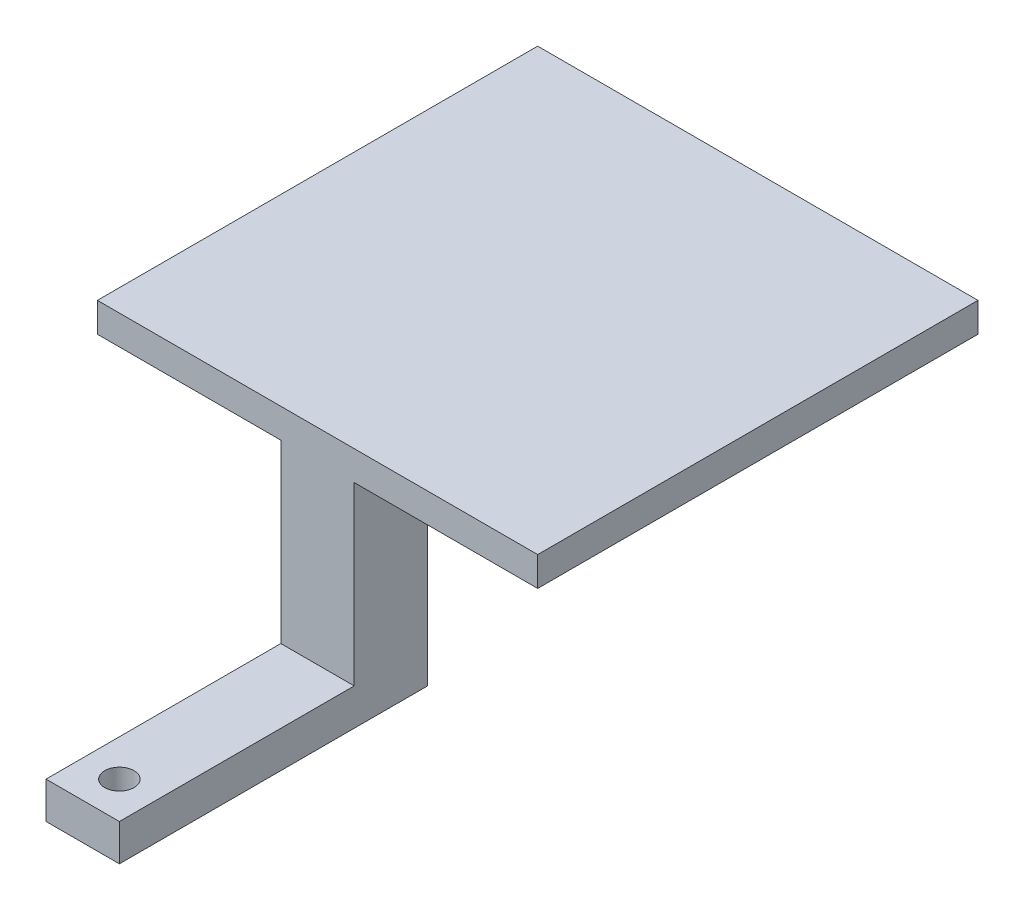
ISO-10303-21;
HEADER;
FILE_DESCRIPTION(('STEP AP214'),'2;1');
FILE_NAME('part.step','',(''),(''),'','','');
FILE_SCHEMA(('AUTOMOTIVE_DESIGN { 1 0 10303 214 1 1 1 1 }'));
ENDSEC;
DATA;
#1=APPLICATION_CONTEXT('core data for automotive mechanical design processes');
#2=APPLICATION_PROTOCOL_DEFINITION('international standard','automotive_design',2000,#1);
#3=PRODUCT_CONTEXT('',#1,'mechanical');
#4=PRODUCT('Part','Part','',(#3));
#5=PRODUCT_RELATED_PRODUCT_CATEGORY('part','',(#4));
#6=PRODUCT_DEFINITION_FORMATION('','',#4);
#7=PRODUCT_DEFINITION_CONTEXT('part definition',#1,'design');
#8=PRODUCT_DEFINITION('design','',#6,#7);
#9=PRODUCT_DEFINITION_SHAPE('','',#8);
#10=(LENGTH_UNIT() NAMED_UNIT(*) SI_UNIT(.MILLI.,.METRE.));
#11=(NAMED_UNIT(*) PLANE_ANGLE_UNIT() SI_UNIT($,.RADIAN.));
#12=(NAMED_UNIT(*) SI_UNIT($,.STERADIAN.) SOLID_ANGLE_UNIT());
#13=UNCERTAINTY_MEASURE_WITH_UNIT(LENGTH_MEASURE(1.E-05),#10,'distance_accuracy_value','');
#14=(GEOMETRIC_REPRESENTATION_CONTEXT(3) GLOBAL_UNCERTAINTY_ASSIGNED_CONTEXT((#13)) GLOBAL_UNIT_ASSIGNED_CONTEXT((#10,
#11,#12)) REPRESENTATION_CONTEXT('',''));
#15=CARTESIAN_POINT('',(0.,0.,0.));
#16=DIRECTION('',(0.,0.,1.));
#17=DIRECTION('',(1.,0.,0.));
#18=AXIS2_PLACEMENT_3D('',#15,#16,#17);
#19=CARTESIAN_POINT('',(-15.,2.,15.));
#20=DIRECTION('',(0.,0.,-1.));
#21=DIRECTION('',(-1.,0.,0.));
#22=AXIS2_PLACEMENT_3D('',#19,#20,#21);
#23=PLANE('',#22);
#24=DIRECTION('',(-1.,0.,0.));
#25=VECTOR('',#24,1.);
#26=CARTESIAN_POINT('',(2.50000000000001,-12.,15.));
#27=LINE('',#26,#25);
#28=CARTESIAN_POINT('',(2.50000000000001,-12.,15.));
#29=VERTEX_POINT('',#28);
#30=CARTESIAN_POINT('',(-2.5,-12.,15.));
#31=VERTEX_POINT('',#30);
#32=EDGE_CURVE('E56',#29,#31,#27,.T.);
#33=ORIENTED_EDGE('',*,*,#32,.F.);
#34=DIRECTION('',(0.,1.,0.));
#35=VECTOR('',#34,1.);
#36=CARTESIAN_POINT('',(2.50000000000001,-14.5,15.));
#37=LINE('',#36,#35);
#38=CARTESIAN_POINT('',(2.50000000000001,0.,15.));
#39=VERTEX_POINT('',#38);
#40=EDGE_CURVE('E167',#29,#39,#37,.T.);
#41=ORIENTED_EDGE('',*,*,#40,.T.);
#42=DIRECTION('',(1.,0.,0.));
#43=VECTOR('',#42,1.);
#44=CARTESIAN_POINT('',(-15.,0.,15.));
#45=LINE('',#44,#43);
#46=CARTESIAN_POINT('',(15.,0.,15.));
#47=VERTEX_POINT('',#46);
#48=EDGE_CURVE('E190',#39,#47,#45,.T.);
#49=ORIENTED_EDGE('',*,*,#48,.T.);
#50=DIRECTION('',(0.,-1.,0.));
#51=VECTOR('',#50,1.);
#52=CARTESIAN_POINT('',(15.,2.,15.));
#53=LINE('',#52,#51);
#54=CARTESIAN_POINT('',(15.,2.,15.));
#55=VERTEX_POINT('',#54);
#56=EDGE_CURVE('E183',#55,#47,#53,.T.);
#57=ORIENTED_EDGE('',*,*,#56,.F.);
#58=DIRECTION('',(1.,0.,0.));
#59=VECTOR('',#58,1.);
#60=CARTESIAN_POINT('',(-15.,2.,15.));
#61=LINE('',#60,#59);
#62=CARTESIAN_POINT('',(-15.,2.,15.));
#63=VERTEX_POINT('',#62);
#64=EDGE_CURVE('E181',#63,#55,#61,.T.);
#65=ORIENTED_EDGE('',*,*,#64,.F.);
#66=DIRECTION('',(0.,-1.,0.));
#67=VECTOR('',#66,1.);
#68=CARTESIAN_POINT('',(-15.,2.,15.));
#69=LINE('',#68,#67);
#70=CARTESIAN_POINT('',(-15.,0.,15.));
#71=VERTEX_POINT('',#70);
#72=EDGE_CURVE('E195',#63,#71,#69,.T.);
#73=ORIENTED_EDGE('',*,*,#72,.T.);
#74=CARTESIAN_POINT('',(-2.5,0.,15.));
#75=VERTEX_POINT('',#74);
#76=EDGE_CURVE('E177',#71,#75,#45,.T.);
#77=ORIENTED_EDGE('',*,*,#76,.T.);
#78=DIRECTION('',(0.,1.,0.));
#79=VECTOR('',#78,1.);
#80=CARTESIAN_POINT('',(-2.5,-14.5,15.));
#81=LINE('',#80,#79);
#82=EDGE_CURVE('E165',#31,#75,#81,.T.);
#83=ORIENTED_EDGE('',*,*,#82,.F.);
#84=EDGE_LOOP('',(#33,#41,#49,#57,#65,#73,#77,#83));
#85=FACE_BOUND('',#84,.T.);
#86=ADVANCED_FACE('F40',(#85),#23,.F.);
#87=CARTESIAN_POINT('',(0.,0.,0.));
#88=DIRECTION('',(0.,1.,0.));
#89=DIRECTION('',(0.,0.,1.));
#90=AXIS2_PLACEMENT_3D('',#87,#88,#89);
#91=PLANE('',#90);
#92=DIRECTION('',(0.,0.,-1.));
#93=VECTOR('',#92,1.);
#94=CARTESIAN_POINT('',(-2.5,0.,0.));
#95=LINE('',#94,#93);
#96=CARTESIAN_POINT('',(-2.5,0.,10.));
#97=VERTEX_POINT('',#96);
#98=EDGE_CURVE('E157',#75,#97,#95,.T.);
#99=ORIENTED_EDGE('',*,*,#98,.F.);
#100=ORIENTED_EDGE('',*,*,#76,.F.);
#101=DIRECTION('',(0.,0.,1.));
#102=VECTOR('',#101,1.);
#103=CARTESIAN_POINT('',(-15.,0.,-15.));
#104=LINE('',#103,#102);
#105=CARTESIAN_POINT('',(-15.,0.,-15.));
#106=VERTEX_POINT('',#105);
#107=EDGE_CURVE('E188',#106,#71,#104,.T.);
#108=ORIENTED_EDGE('',*,*,#107,.F.);
#109=DIRECTION('',(-1.,0.,0.));
#110=VECTOR('',#109,1.);
#111=CARTESIAN_POINT('',(-15.,0.,-15.));
#112=LINE('',#111,#110);
#113=CARTESIAN_POINT('',(15.,0.,-15.));
#114=VERTEX_POINT('',#113);
#115=EDGE_CURVE('E186',#114,#106,#112,.T.);
#116=ORIENTED_EDGE('',*,*,#115,.F.);
#117=DIRECTION('',(0.,0.,-1.));
#118=VECTOR('',#117,1.);
#119=CARTESIAN_POINT('',(15.,0.,-15.));
#120=LINE('',#119,#118);
#121=EDGE_CURVE('E172',#47,#114,#120,.T.);
#122=ORIENTED_EDGE('',*,*,#121,.F.);
#123=ORIENTED_EDGE('',*,*,#48,.F.);
#124=DIRECTION('',(0.,0.,1.));
#125=VECTOR('',#124,1.);
#126=CARTESIAN_POINT('',(2.50000000000001,0.,0.));
#127=LINE('',#126,#125);
#128=CARTESIAN_POINT('',(2.50000000000001,0.,10.));
#129=VERTEX_POINT('',#128);
#130=EDGE_CURVE('E160',#129,#39,#127,.T.);
#131=ORIENTED_EDGE('',*,*,#130,.F.);
#132=DIRECTION('',(1.,0.,0.));
#133=VECTOR('',#132,1.);
#134=CARTESIAN_POINT('',(0.,0.,10.));
#135=LINE('',#134,#133);
#136=EDGE_CURVE('E64',#97,#129,#135,.T.);
#137=ORIENTED_EDGE('',*,*,#136,.F.);
#138=EDGE_LOOP('',(#99,#100,#108,#116,#122,#123,#131,#137));
#139=FACE_BOUND('',#138,.T.);
#140=ADVANCED_FACE('F207',(#139),#91,.F.);
#141=CARTESIAN_POINT('',(15.,2.,-15.));
#142=DIRECTION('',(-1.,0.,0.));
#143=DIRECTION('',(0.,0.,1.));
#144=AXIS2_PLACEMENT_3D('',#141,#142,#143);
#145=PLANE('',#144);
#146=ORIENTED_EDGE('',*,*,#121,.T.);
#147=DIRECTION('',(0.,-1.,0.));
#148=VECTOR('',#147,1.);
#149=CARTESIAN_POINT('',(15.,2.,-15.));
#150=LINE('',#149,#148);
#151=CARTESIAN_POINT('',(15.,2.,-15.));
#152=VERTEX_POINT('',#151);
#153=EDGE_CURVE('E11',#152,#114,#150,.T.);
#154=ORIENTED_EDGE('',*,*,#153,.F.);
#155=DIRECTION('',(0.,0.,-1.));
#156=VECTOR('',#155,1.);
#157=CARTESIAN_POINT('',(15.,2.,-15.));
#158=LINE('',#157,#156);
#159=EDGE_CURVE('E173',#55,#152,#158,.T.);
#160=ORIENTED_EDGE('',*,*,#159,.F.);
#161=ORIENTED_EDGE('',*,*,#56,.T.);
#162=EDGE_LOOP('',(#146,#154,#160,#161));
#163=FACE_BOUND('',#162,.T.);
#164=ADVANCED_FACE('F42',(#163),#145,.F.);
#165=CARTESIAN_POINT('',(-15.,2.,-15.));
#166=DIRECTION('',(0.,0.,1.));
#167=DIRECTION('',(1.,0.,0.));
#168=AXIS2_PLACEMENT_3D('',#165,#166,#167);
#169=PLANE('',#168);
#170=ORIENTED_EDGE('',*,*,#115,.T.);
#171=DIRECTION('',(0.,-1.,0.));
#172=VECTOR('',#171,1.);
#173=CARTESIAN_POINT('',(-15.,2.,-15.));
#174=LINE('',#173,#172);
#175=CARTESIAN_POINT('',(-15.,2.,-15.));
#176=VERTEX_POINT('',#175);
#177=EDGE_CURVE('E49',#176,#106,#174,.T.);
#178=ORIENTED_EDGE('',*,*,#177,.F.);
#179=DIRECTION('',(-1.,0.,0.));
#180=VECTOR('',#179,1.);
#181=CARTESIAN_POINT('',(-15.,2.,-15.));
#182=LINE('',#181,#180);
#183=EDGE_CURVE('E176',#152,#176,#182,.T.);
#184=ORIENTED_EDGE('',*,*,#183,.F.);
#185=ORIENTED_EDGE('',*,*,#153,.T.);
#186=EDGE_LOOP('',(#170,#178,#184,#185));
#187=FACE_BOUND('',#186,.T.);
#188=ADVANCED_FACE('F215',(#187),#169,.F.);
#189=CARTESIAN_POINT('',(-15.,2.,-15.));
#190=DIRECTION('',(1.,0.,0.));
#191=DIRECTION('',(0.,0.,-1.));
#192=AXIS2_PLACEMENT_3D('',#189,#190,#191);
#193=PLANE('',#192);
#194=ORIENTED_EDGE('',*,*,#107,.T.);
#195=ORIENTED_EDGE('',*,*,#72,.F.);
#196=DIRECTION('',(0.,0.,1.));
#197=VECTOR('',#196,1.);
#198=CARTESIAN_POINT('',(-15.,2.,-15.));
#199=LINE('',#198,#197);
#200=EDGE_CURVE('E179',#176,#63,#199,.T.);
#201=ORIENTED_EDGE('',*,*,#200,.F.);
#202=ORIENTED_EDGE('',*,*,#177,.T.);
#203=EDGE_LOOP('',(#194,#195,#201,#202));
#204=FACE_BOUND('',#203,.T.);
#205=ADVANCED_FACE('F203',(#204),#193,.F.);
#206=CARTESIAN_POINT('',(0.,2.,0.));
#207=DIRECTION('',(0.,1.,0.));
#208=DIRECTION('',(0.,0.,1.));
#209=AXIS2_PLACEMENT_3D('',#206,#207,#208);
#210=PLANE('',#209);
#211=ORIENTED_EDGE('',*,*,#159,.T.);
#212=ORIENTED_EDGE('',*,*,#183,.T.);
#213=ORIENTED_EDGE('',*,*,#200,.T.);
#214=ORIENTED_EDGE('',*,*,#64,.T.);
#215=EDGE_LOOP('',(#211,#212,#213,#214));
#216=FACE_BOUND('',#215,.T.);
#217=ADVANCED_FACE('F213',(#216),#210,.T.);
#218=CARTESIAN_POINT('',(0.,-14.5,10.));
#219=DIRECTION('',(0.,0.,1.));
#220=DIRECTION('',(1.,0.,0.));
#221=AXIS2_PLACEMENT_3D('',#218,#219,#220);
#222=PLANE('',#221);
#223=ORIENTED_EDGE('',*,*,#136,.T.);
#224=DIRECTION('',(0.,1.,0.));
#225=VECTOR('',#224,1.);
#226=CARTESIAN_POINT('',(2.50000000000001,-14.5,10.));
#227=LINE('',#226,#225);
#228=CARTESIAN_POINT('',(2.50000000000001,-14.5,10.));
#229=VERTEX_POINT('',#228);
#230=EDGE_CURVE('E169',#229,#129,#227,.T.);
#231=ORIENTED_EDGE('',*,*,#230,.F.);
#232=DIRECTION('',(1.,0.,0.));
#233=VECTOR('',#232,1.);
#234=CARTESIAN_POINT('',(0.,-14.5,10.));
#235=LINE('',#234,#233);
#236=CARTESIAN_POINT('',(-2.5,-14.5,10.));
#237=VERTEX_POINT('',#236);
#238=EDGE_CURVE('E155',#237,#229,#235,.T.);
#239=ORIENTED_EDGE('',*,*,#238,.F.);
#240=DIRECTION('',(0.,1.,0.));
#241=VECTOR('',#240,1.);
#242=CARTESIAN_POINT('',(-2.5,-14.5,10.));
#243=LINE('',#242,#241);
#244=EDGE_CURVE('E126',#237,#97,#243,.T.);
#245=ORIENTED_EDGE('',*,*,#244,.T.);
#246=EDGE_LOOP('',(#223,#231,#239,#245));
#247=FACE_BOUND('',#246,.T.);
#248=ADVANCED_FACE('F223',(#247),#222,.F.);
#249=CARTESIAN_POINT('',(2.50000000000001,-14.5,0.));
#250=DIRECTION('',(-1.,0.,0.));
#251=DIRECTION('',(0.,0.,1.));
#252=AXIS2_PLACEMENT_3D('',#249,#250,#251);
#253=PLANE('',#252);
#254=ORIENTED_EDGE('',*,*,#130,.T.);
#255=ORIENTED_EDGE('',*,*,#40,.F.);
#256=DIRECTION('',(0.,0.,-1.));
#257=VECTOR('',#256,1.);
#258=CARTESIAN_POINT('',(2.50000000000001,-12.,31.));
#259=LINE('',#258,#257);
#260=CARTESIAN_POINT('',(2.50000000000001,-12.,31.));
#261=VERTEX_POINT('',#260);
#262=EDGE_CURVE('E152',#261,#29,#259,.T.);
#263=ORIENTED_EDGE('',*,*,#262,.F.);
#264=DIRECTION('',(0.,1.,0.));
#265=VECTOR('',#264,1.);
#266=CARTESIAN_POINT('',(2.50000000000001,-14.5,31.));
#267=LINE('',#266,#265);
#268=CARTESIAN_POINT('',(2.50000000000001,-14.5,31.));
#269=VERTEX_POINT('',#268);
#270=EDGE_CURVE('E137',#269,#261,#267,.T.);
#271=ORIENTED_EDGE('',*,*,#270,.F.);
#272=DIRECTION('',(0.,0.,1.));
#273=VECTOR('',#272,1.);
#274=CARTESIAN_POINT('',(2.50000000000001,-14.5,0.));
#275=LINE('',#274,#273);
#276=EDGE_CURVE('E130',#229,#269,#275,.T.);
#277=ORIENTED_EDGE('',*,*,#276,.F.);
#278=ORIENTED_EDGE('',*,*,#230,.T.);
#279=EDGE_LOOP('',(#254,#255,#263,#271,#277,#278));
#280=FACE_BOUND('',#279,.T.);
#281=ADVANCED_FACE('F219',(#280),#253,.F.);
#282=CARTESIAN_POINT('',(-2.5,-14.5,0.));
#283=DIRECTION('',(1.,0.,0.));
#284=DIRECTION('',(0.,0.,-1.));
#285=AXIS2_PLACEMENT_3D('',#282,#283,#284);
#286=PLANE('',#285);
#287=ORIENTED_EDGE('',*,*,#98,.T.);
#288=ORIENTED_EDGE('',*,*,#244,.F.);
#289=DIRECTION('',(0.,0.,-1.));
#290=VECTOR('',#289,1.);
#291=CARTESIAN_POINT('',(-2.5,-14.5,0.));
#292=LINE('',#291,#290);
#293=CARTESIAN_POINT('',(-2.5,-14.5,31.));
#294=VERTEX_POINT('',#293);
#295=EDGE_CURVE('E119',#294,#237,#292,.T.);
#296=ORIENTED_EDGE('',*,*,#295,.F.);
#297=DIRECTION('',(0.,-1.,0.));
#298=VECTOR('',#297,1.);
#299=CARTESIAN_POINT('',(-2.5,-12.,31.));
#300=LINE('',#299,#298);
#301=CARTESIAN_POINT('',(-2.5,-12.,31.));
#302=VERTEX_POINT('',#301);
#303=EDGE_CURVE('E124',#302,#294,#300,.T.);
#304=ORIENTED_EDGE('',*,*,#303,.F.);
#305=DIRECTION('',(0.,0.,-1.));
#306=VECTOR('',#305,1.);
#307=CARTESIAN_POINT('',(-2.5,-12.,31.));
#308=LINE('',#307,#306);
#309=EDGE_CURVE('E149',#302,#31,#308,.T.);
#310=ORIENTED_EDGE('',*,*,#309,.T.);
#311=ORIENTED_EDGE('',*,*,#82,.T.);
#312=EDGE_LOOP('',(#287,#288,#296,#304,#310,#311));
#313=FACE_BOUND('',#312,.T.);
#314=ADVANCED_FACE('F121',(#313),#286,.F.);
#315=CARTESIAN_POINT('',(0.,-14.5,0.));
#316=DIRECTION('',(0.,-1.,0.));
#317=DIRECTION('',(0.,0.,-1.));
#318=AXIS2_PLACEMENT_3D('',#315,#316,#317);
#319=PLANE('',#318);
#320=CARTESIAN_POINT('',(0.,-14.5,28.5));
#321=DIRECTION('',(0.,-1.,0.));
#322=DIRECTION('',(0.,0.,-1.));
#323=AXIS2_PLACEMENT_3D('',#320,#321,#322);
#324=CIRCLE('',#323,1.);
#325=CARTESIAN_POINT('',(0.,-14.5,27.5));
#326=VERTEX_POINT('',#325);
#327=EDGE_CURVE('E146',#326,#326,#324,.T.);
#328=ORIENTED_EDGE('',*,*,#327,.F.);
#329=EDGE_LOOP('',(#328));
#330=FACE_BOUND('',#329,.T.);
#331=ORIENTED_EDGE('',*,*,#238,.T.);
#332=ORIENTED_EDGE('',*,*,#276,.T.);
#333=DIRECTION('',(1.,0.,0.));
#334=VECTOR('',#333,1.);
#335=CARTESIAN_POINT('',(-2.5,-14.5,31.));
#336=LINE('',#335,#334);
#337=EDGE_CURVE('E133',#294,#269,#336,.T.);
#338=ORIENTED_EDGE('',*,*,#337,.F.);
#339=ORIENTED_EDGE('',*,*,#295,.T.);
#340=EDGE_LOOP('',(#331,#332,#338,#339));
#341=FACE_BOUND('',#340,.T.);
#342=ADVANCED_FACE('F134',(#330,#341),#319,.T.);
#343=CARTESIAN_POINT('',(2.50000000000001,-12.,31.));
#344=DIRECTION('',(0.,-1.,0.));
#345=DIRECTION('',(0.,0.,-1.));
#346=AXIS2_PLACEMENT_3D('',#343,#344,#345);
#347=PLANE('',#346);
#348=CARTESIAN_POINT('',(0.,-12.,28.5));
#349=DIRECTION('',(0.,-1.,0.));
#350=DIRECTION('',(0.,0.,-1.));
#351=AXIS2_PLACEMENT_3D('',#348,#349,#350);
#352=CIRCLE('',#351,1.);
#353=CARTESIAN_POINT('',(0.,-12.,27.5));
#354=VERTEX_POINT('',#353);
#355=EDGE_CURVE('E44',#354,#354,#352,.T.);
#356=ORIENTED_EDGE('',*,*,#355,.T.);
#357=EDGE_LOOP('',(#356));
#358=FACE_BOUND('',#357,.T.);
#359=ORIENTED_EDGE('',*,*,#32,.T.);
#360=ORIENTED_EDGE('',*,*,#309,.F.);
#361=DIRECTION('',(-1.,0.,0.));
#362=VECTOR('',#361,1.);
#363=CARTESIAN_POINT('',(2.50000000000001,-12.,31.));
#364=LINE('',#363,#362);
#365=EDGE_CURVE('E141',#261,#302,#364,.T.);
#366=ORIENTED_EDGE('',*,*,#365,.F.);
#367=ORIENTED_EDGE('',*,*,#262,.T.);
#368=EDGE_LOOP('',(#359,#360,#366,#367));
#369=FACE_BOUND('',#368,.T.);
#370=ADVANCED_FACE('F291',(#358,#369),#347,.F.);
#371=CARTESIAN_POINT('',(0.,0.,31.));
#372=DIRECTION('',(0.,0.,1.));
#373=DIRECTION('',(1.,0.,0.));
#374=AXIS2_PLACEMENT_3D('',#371,#372,#373);
#375=PLANE('',#374);
#376=ORIENTED_EDGE('',*,*,#303,.T.);
#377=ORIENTED_EDGE('',*,*,#337,.T.);
#378=ORIENTED_EDGE('',*,*,#270,.T.);
#379=ORIENTED_EDGE('',*,*,#365,.T.);
#380=EDGE_LOOP('',(#376,#377,#378,#379));
#381=FACE_BOUND('',#380,.T.);
#382=ADVANCED_FACE('F139',(#381),#375,.T.);
#383=CARTESIAN_POINT('',(0.,-9.5,28.5));
#384=DIRECTION('',(0.,-1.,0.));
#385=DIRECTION('',(0.,0.,-1.));
#386=AXIS2_PLACEMENT_3D('',#383,#384,#385);
#387=CYLINDRICAL_SURFACE('',#386,1.);
#388=ORIENTED_EDGE('',*,*,#327,.T.);
#389=EDGE_LOOP('',(#388));
#390=FACE_BOUND('',#389,.T.);
#391=ORIENTED_EDGE('',*,*,#355,.F.);
#392=EDGE_LOOP('',(#391));
#393=FACE_BOUND('',#392,.T.);
#394=ADVANCED_FACE('F290',(#390,#393),#387,.F.);
#395=CLOSED_SHELL('',(#86,#140,#164,#188,#205,#217,#248,#281,#314,#342,#370,#382,#394));
#396=MANIFOLD_SOLID_BREP('B2',#395);
#397=ADVANCED_BREP_SHAPE_REPRESENTATION('',(#18,#396),#14);
#398=SHAPE_DEFINITION_REPRESENTATION(#9,#397);
ENDSEC;
END-ISO-10303-21;
